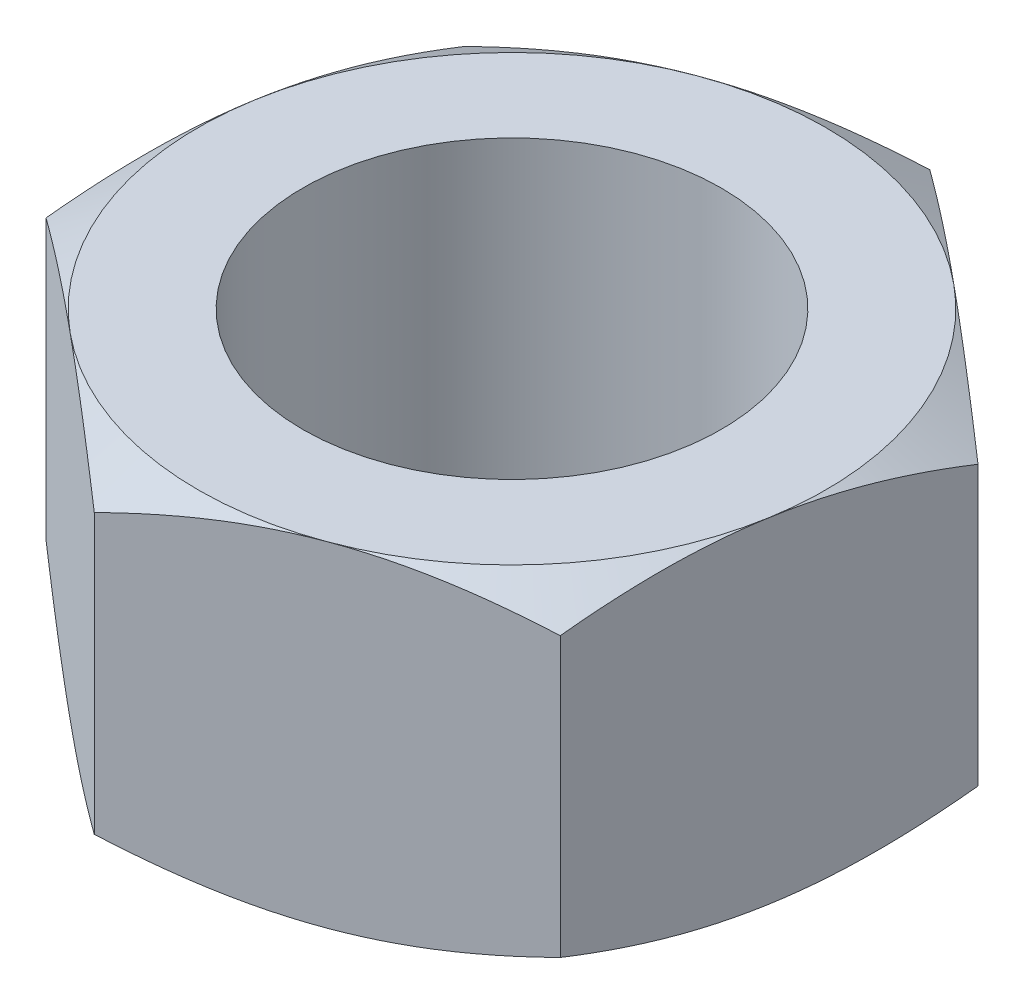
ISO-10303-21;
HEADER;
FILE_DESCRIPTION(('STEP AP214'),'2;1');
FILE_NAME('part.step','',(''),(''),'','','');
FILE_SCHEMA(('AUTOMOTIVE_DESIGN { 1 0 10303 214 1 1 1 1 }'));
ENDSEC;
DATA;
#1=APPLICATION_CONTEXT('core data for automotive mechanical design processes');
#2=APPLICATION_PROTOCOL_DEFINITION('international standard','automotive_design',2000,#1);
#3=PRODUCT_CONTEXT('',#1,'mechanical');
#4=PRODUCT('Part','Part','',(#3));
#5=PRODUCT_RELATED_PRODUCT_CATEGORY('part','',(#4));
#6=PRODUCT_DEFINITION_FORMATION('','',#4);
#7=PRODUCT_DEFINITION_CONTEXT('part definition',#1,'design');
#8=PRODUCT_DEFINITION('design','',#6,#7);
#9=PRODUCT_DEFINITION_SHAPE('','',#8);
#10=(LENGTH_UNIT() NAMED_UNIT(*) SI_UNIT(.MILLI.,.METRE.));
#11=(NAMED_UNIT(*) PLANE_ANGLE_UNIT() SI_UNIT($,.RADIAN.));
#12=(NAMED_UNIT(*) SI_UNIT($,.STERADIAN.) SOLID_ANGLE_UNIT());
#13=UNCERTAINTY_MEASURE_WITH_UNIT(LENGTH_MEASURE(1.E-05),#10,'distance_accuracy_value','');
#14=(GEOMETRIC_REPRESENTATION_CONTEXT(3) GLOBAL_UNCERTAINTY_ASSIGNED_CONTEXT((#13)) GLOBAL_UNIT_ASSIGNED_CONTEXT((#10,
#11,#12)) REPRESENTATION_CONTEXT('',''));
#15=CARTESIAN_POINT('',(0.,0.,0.));
#16=DIRECTION('',(0.,0.,1.));
#17=DIRECTION('',(1.,0.,0.));
#18=AXIS2_PLACEMENT_3D('',#15,#16,#17);
#19=CARTESIAN_POINT('',(-1.44369467023749,8.,8.53907171179209));
#20=DIRECTION('',(-0.34863406811952,0.,-0.937258921828133));
#21=DIRECTION('',(-0.937258921828133,0.,0.34863406811952));
#22=AXIS2_PLACEMENT_3D('',#19,#20,#21);
#23=PLANE('',#22);
#24=CARTESIAN_POINT('',(6.67340569203028,0.669934582085275,5.51973772123151));
#25=CARTESIAN_POINT('',(6.49498732644152,0.61499041368803,5.58610435607892));
#26=CARTESIAN_POINT('',(6.31590373120375,0.562539844764627,5.65271843772397));
#27=CARTESIAN_POINT('',(5.95628219341445,0.463312688605474,5.78648757748136));
#28=CARTESIAN_POINT('',(5.77574365902302,0.416538549046466,5.85364285574156));
#29=CARTESIAN_POINT('',(5.23123744179099,0.285648891076474,6.05618391799114));
#30=CARTESIAN_POINT('',(4.86512041892743,0.211200490063354,6.19236919627024));
#31=CARTESIAN_POINT('',(4.31723296252882,0.123901221271782,6.39616798478786));
#32=CARTESIAN_POINT('',(4.13709953241467,0.0990322370979437,6.46317257560309));
#33=CARTESIAN_POINT('',(3.77601876178583,0.0573306993877993,6.59748450910651));
#34=CARTESIAN_POINT('',(3.59507149461047,0.0404974357964017,6.66479182451452));
#35=CARTESIAN_POINT('',(3.23286270958824,0.0152963397422831,6.79952334777878));
#36=CARTESIAN_POINT('',(3.05160178328159,0.00691890019796405,6.86694733559865));
#37=CARTESIAN_POINT('',(2.68892251831363,-0.00119990207370901,7.0018538642255));
#38=CARTESIAN_POINT('',(2.50750418468866,-0.000941531608342203,7.0693364031591));
#39=CARTESIAN_POINT('',(2.01048216082673,0.0116366203444909,7.25421467541497));
#40=CARTESIAN_POINT('',(1.69504118336627,0.032750367326311,7.37154988414164));
#41=CARTESIAN_POINT('',(1.06625435166348,0.0997010500425559,7.60544097443817));
#42=CARTESIAN_POINT('',(0.752910708611471,0.145560867086196,7.72199603350715));
#43=CARTESIAN_POINT('',(0.122858541479935,0.260196634976687,7.95635779314358));
#44=CARTESIAN_POINT('',(-0.19377048564775,0.32945826489346,8.0741349230715));
#45=CARTESIAN_POINT('',(-0.822306823607496,0.486654039468555,8.30793283671146));
#46=CARTESIAN_POINT('',(-1.13422218333332,0.574551261711175,8.42395661438654));
#47=CARTESIAN_POINT('',(-1.44389467023749,0.669934582085275,8.53914610619048));
#48=B_SPLINE_CURVE_WITH_KNOTS('',3,(#24,#25,#26,#27,#28,#29,#30,#31,#32,#33,#34,#35,#36,#37,#38,
#39,#40,#41,#42,#43,#44,#45,#46,#47),.UNSPECIFIED.,.F.,.F.,(4,2,2,2,2,2,2,2,2,2,2,4),(0.,
0.594350167566524,1.18895571516085,2.38063749631713,2.96188394546358,3.54307902480116,
4.12361303374696,4.70412910684701,5.71472439101079,6.7262557214494,7.76022088252539,
8.79215629474527),.UNSPECIFIED.);
#49=CARTESIAN_POINT('',(6.67320569203028,0.669872981077802,5.5198121156299));
#50=VERTEX_POINT('',#49);
#51=CARTESIAN_POINT('',(2.6147555108964,0.,7.029441913711));
#52=VERTEX_POINT('',#51);
#53=EDGE_CURVE('E125',#50,#52,#48,.T.);
#54=ORIENTED_EDGE('',*,*,#53,.F.);
#55=DIRECTION('',(0.,-1.,0.));
#56=VECTOR('',#55,1.);
#57=CARTESIAN_POINT('',(6.67320569203028,8.,5.5198121156299));
#58=LINE('',#57,#56);
#59=CARTESIAN_POINT('',(6.67320569203028,7.3301270189222,5.5198121156299));
#60=VERTEX_POINT('',#59);
#61=EDGE_CURVE('E247',#60,#50,#58,.T.);
#62=ORIENTED_EDGE('',*,*,#61,.F.);
#63=CARTESIAN_POINT('',(-1.44389467023749,7.33006541791473,8.53914610619048));
#64=CARTESIAN_POINT('',(-1.26547630464873,7.38500958631197,8.47277947134307));
#65=CARTESIAN_POINT('',(-1.08639270941096,7.43746015523537,8.40616538969802));
#66=CARTESIAN_POINT('',(-0.726771171621659,7.53668731139453,8.27239624994063));
#67=CARTESIAN_POINT('',(-0.54623263723023,7.58346145095353,8.20524097168044));
#68=CARTESIAN_POINT('',(-0.00172641999819791,7.71435110892353,8.00269990943085));
#69=CARTESIAN_POINT('',(0.364390602865364,7.78879950993665,7.86651463115175));
#70=CARTESIAN_POINT('',(0.912278059263968,7.87609877872822,7.66271584263413));
#71=CARTESIAN_POINT('',(1.09241148937812,7.90096776290206,7.5957112518189));
#72=CARTESIAN_POINT('',(1.45349226000696,7.9426693006122,7.46139931831548));
#73=CARTESIAN_POINT('',(1.63443952718232,7.9595025642036,7.39409200290748));
#74=CARTESIAN_POINT('',(1.99664831220455,7.98470366025772,7.25936047964321));
#75=CARTESIAN_POINT('',(2.1779092385112,7.99308109980204,7.19193649182334));
#76=CARTESIAN_POINT('',(2.54058850347916,8.00119990207371,7.0570299631965));
#77=CARTESIAN_POINT('',(2.72200683710413,8.00094153160834,6.98954742426289));
#78=CARTESIAN_POINT('',(3.21902886096606,7.98836337965551,6.80466915200702));
#79=CARTESIAN_POINT('',(3.53446983842652,7.96724963267369,6.68733394328035));
#80=CARTESIAN_POINT('',(4.16325667012932,7.90029894995745,6.45344285298383));
#81=CARTESIAN_POINT('',(4.47660031318132,7.85443913291381,6.33688779391484));
#82=CARTESIAN_POINT('',(5.10665248031286,7.73980336502331,6.10252603427841));
#83=CARTESIAN_POINT('',(5.42328150744054,7.67054173510654,5.98474890435049));
#84=CARTESIAN_POINT('',(6.05181784540029,7.51334596053145,5.75095099071054));
#85=CARTESIAN_POINT('',(6.36373320512611,7.42544873828883,5.63492721303545));
#86=CARTESIAN_POINT('',(6.67340569203028,7.33006541791473,5.51973772123151));
#87=B_SPLINE_CURVE_WITH_KNOTS('',3,(#63,#64,#65,#66,#67,#68,#69,#70,#71,#72,#73,#74,#75,#76,#77,
#78,#79,#80,#81,#82,#83,#84,#85,#86),.UNSPECIFIED.,.F.,.F.,(4,2,2,2,2,2,2,2,2,2,2,4),(0.,
0.594350167566525,1.18895571516085,2.38063749631713,2.96188394546358,3.54307902480116,
4.12361303374695,4.704129106847,5.71472439101079,6.7262557214494,7.76022088252539,
8.79215629474526),.UNSPECIFIED.);
#88=CARTESIAN_POINT('',(2.6147555108964,8.,7.029441913711));
#89=VERTEX_POINT('',#88);
#90=EDGE_CURVE('E228',#89,#60,#87,.T.);
#91=ORIENTED_EDGE('',*,*,#90,.F.);
#92=CARTESIAN_POINT('',(-1.44369467023749,7.3301270189222,8.53907171179209));
#93=VERTEX_POINT('',#92);
#94=EDGE_CURVE('E233',#93,#89,#87,.T.);
#95=ORIENTED_EDGE('',*,*,#94,.F.);
#96=DIRECTION('',(0.,-1.,0.));
#97=VECTOR('',#96,1.);
#98=CARTESIAN_POINT('',(-1.44369467023749,8.,8.53907171179209));
#99=LINE('',#98,#97);
#100=CARTESIAN_POINT('',(-1.44369467023749,0.669872981077804,8.53907171179209));
#101=VERTEX_POINT('',#100);
#102=EDGE_CURVE('E155',#93,#101,#99,.T.);
#103=ORIENTED_EDGE('',*,*,#102,.T.);
#104=EDGE_CURVE('E137',#52,#101,#48,.T.);
#105=ORIENTED_EDGE('',*,*,#104,.F.);
#106=EDGE_LOOP('',(#54,#62,#91,#95,#103,#105));
#107=FACE_BOUND('',#106,.T.);
#108=ADVANCED_FACE('F35',(#107),#23,.F.);
#109=CARTESIAN_POINT('',(6.67320569203028,8.,5.5198121156299));
#110=DIRECTION('',(-0.986007070286536,0.,-0.166703501297848));
#111=DIRECTION('',(-0.166703501297848,0.,0.986007070286536));
#112=AXIS2_PLACEMENT_3D('',#109,#110,#111);
#113=PLANE('',#112);
#114=CARTESIAN_POINT('',(8.11693417612292,0.669931536480535,-3.01945959616219));
#115=CARTESIAN_POINT('',(8.08520019987834,0.614987494088027,-2.83176152922384));
#116=CARTESIAN_POINT('',(8.05334790409476,0.562537054216301,-2.64336363354107));
#117=CARTESIAN_POINT('',(7.98938463854219,0.463310161762978,-2.26503785404366));
#118=CARTESIAN_POINT('',(7.95727356350703,0.416536156859956,-2.07510934760759));
#119=CARTESIAN_POINT('',(7.86042620741353,0.285646912260097,-1.50228287963715));
#120=CARTESIAN_POINT('',(7.79530763940616,0.211198797092288,-1.1171237920216));
#121=CARTESIAN_POINT('',(7.69785888875528,0.123899954229493,-0.54074023448197));
#122=CARTESIAN_POINT('',(7.66581986681431,0.0990311093659153,-0.351237903019766));
#123=CARTESIAN_POINT('',(7.60159705945798,0.0573298489513181,0.0286229975251618));
#124=CARTESIAN_POINT('',(7.56941328708685,0.0404967233463565,0.218981489454664));
#125=CARTESIAN_POINT('',(7.50498984963335,0.01529589836571,0.600029063901351));
#126=CARTESIAN_POINT('',(7.47275028976229,0.00691859196391458,0.790717524121497));
#127=CARTESIAN_POINT('',(7.40824317319374,-0.00119995198440781,1.17226003837705));
#128=CARTESIAN_POINT('',(7.37597561739202,-0.000941456342233855,1.36311408711426));
#129=CARTESIAN_POINT('',(7.2875741645718,0.0116369901313172,1.88598527353643));
#130=CARTESIAN_POINT('',(7.23146920871259,0.0327507878641885,2.21783123192727));
#131=CARTESIAN_POINT('',(7.11963193933104,0.0997013333310603,2.87931906795497));
#132=CARTESIAN_POINT('',(7.06390001908873,0.145560961828871,3.20895861944455));
#133=CARTESIAN_POINT('',(6.95183769884847,0.260196141216312,3.87177757171231));
#134=CARTESIAN_POINT('',(6.89552143817182,0.329457363606809,4.20487334214886));
#135=CARTESIAN_POINT('',(6.78372872548718,0.486652168279931,4.86609763711207));
#136=CARTESIAN_POINT('',(6.72825084191222,0.574548828915974,5.19423462897829));
#137=CARTESIAN_POINT('',(6.67317187817512,0.669931536480536,5.5200121156299));
#138=B_SPLINE_CURVE_WITH_KNOTS('',3,(#114,#115,#116,#117,#118,#119,#120,#121,#122,#123,#124,
#125,#126,#127,#128,#129,#130,#131,#132,#133,#134,#135,#136,#137),.UNSPECIFIED.,.F.,.F.,(4,2,2,
2,2,2,2,2,2,2,2,4),(0.,0.594349806644114,1.1889549931035,2.380636032122,2.96188215456027,
3.54307690729336,4.12361059346092,4.70412634350593,5.71471695893529,6.72624360304106,
7.76020382983172,8.79213434275382),.UNSPECIFIED.);
#139=CARTESIAN_POINT('',(8.11690036226776,0.669872981077801,-3.01925959616219));
#140=VERTEX_POINT('',#139);
#141=CARTESIAN_POINT('',(7.39505302714902,0.,1.25027625973386));
#142=VERTEX_POINT('',#141);
#143=EDGE_CURVE('E52',#140,#142,#138,.T.);
#144=ORIENTED_EDGE('',*,*,#143,.F.);
#145=DIRECTION('',(0.,-1.,0.));
#146=VECTOR('',#145,1.);
#147=CARTESIAN_POINT('',(8.11690036226776,8.,-3.01925959616219));
#148=LINE('',#147,#146);
#149=CARTESIAN_POINT('',(8.11690036226776,7.3301270189222,-3.01925959616219));
#150=VERTEX_POINT('',#149);
#151=EDGE_CURVE('E244',#150,#140,#148,.T.);
#152=ORIENTED_EDGE('',*,*,#151,.F.);
#153=CARTESIAN_POINT('',(6.67317187817512,7.33006846351947,5.5200121156299));
#154=CARTESIAN_POINT('',(6.7049058544197,7.38501250591197,5.33231404869155));
#155=CARTESIAN_POINT('',(6.73675815020328,7.4374629457837,5.14391615300878));
#156=CARTESIAN_POINT('',(6.80072141575585,7.53668983823702,4.76559037351137));
#157=CARTESIAN_POINT('',(6.83283249079101,7.58346384314005,4.57566186707531));
#158=CARTESIAN_POINT('',(6.92967984688451,7.71435308773991,4.00283539910487));
#159=CARTESIAN_POINT('',(6.99479841489188,7.78880120290771,3.61767631148931));
#160=CARTESIAN_POINT('',(7.09224716554276,7.87610004577051,3.04129275394969));
#161=CARTESIAN_POINT('',(7.12428618748373,7.90096889063409,2.85179042248748));
#162=CARTESIAN_POINT('',(7.18850899484006,7.94267015104868,2.47192952194255));
#163=CARTESIAN_POINT('',(7.22069276721119,7.95950327665365,2.28157103001305));
#164=CARTESIAN_POINT('',(7.28511620466469,7.98470410163429,1.90052345556636));
#165=CARTESIAN_POINT('',(7.31735576453575,7.99308140803609,1.70983499534622));
#166=CARTESIAN_POINT('',(7.3818628811043,8.00119995198441,1.32829248109066));
#167=CARTESIAN_POINT('',(7.41413043690602,8.00094145634224,1.13743843235345));
#168=CARTESIAN_POINT('',(7.50253188972624,7.98836300986868,0.614567245931289));
#169=CARTESIAN_POINT('',(7.55863684558545,7.96724921213581,0.282721287540443));
#170=CARTESIAN_POINT('',(7.670474114967,7.90029866666894,-0.378766548487257));
#171=CARTESIAN_POINT('',(7.72620603520931,7.85443903817113,-0.708406099976839));
#172=CARTESIAN_POINT('',(7.83826835544957,7.73980385878369,-1.3712250522446));
#173=CARTESIAN_POINT('',(7.89458461612622,7.67054263639319,-1.70432082268115));
#174=CARTESIAN_POINT('',(8.00637732881086,7.51334783172007,-2.36554511764435));
#175=CARTESIAN_POINT('',(8.06185521238582,7.42545117108403,-2.69368210951058));
#176=CARTESIAN_POINT('',(8.11693417612292,7.33006846351947,-3.01945959616219));
#177=B_SPLINE_CURVE_WITH_KNOTS('',3,(#153,#154,#155,#156,#157,#158,#159,#160,#161,#162,#163,
#164,#165,#166,#167,#168,#169,#170,#171,#172,#173,#174,#175,#176),.UNSPECIFIED.,.F.,.F.,(4,2,2,
2,2,2,2,2,2,2,2,4),(0.,0.594349806644116,1.18895499310351,2.380636032122,2.96188215456027,
3.54307690729336,4.12361059346092,4.70412634350593,5.71471695893529,6.72624360304106,
7.76020382983172,8.79213434275382),.UNSPECIFIED.);
#178=CARTESIAN_POINT('',(7.39505302714903,8.,1.25027625973386));
#179=VERTEX_POINT('',#178);
#180=EDGE_CURVE('E215',#179,#150,#177,.T.);
#181=ORIENTED_EDGE('',*,*,#180,.F.);
#182=EDGE_CURVE('E221',#60,#179,#177,.T.);
#183=ORIENTED_EDGE('',*,*,#182,.F.);
#184=ORIENTED_EDGE('',*,*,#61,.T.);
#185=EDGE_CURVE('E131',#142,#50,#138,.T.);
#186=ORIENTED_EDGE('',*,*,#185,.F.);
#187=EDGE_LOOP('',(#144,#152,#181,#183,#184,#186));
#188=FACE_BOUND('',#187,.T.);
#189=ADVANCED_FACE('F207',(#188),#113,.F.);
#190=CARTESIAN_POINT('',(8.11690036226776,8.,-3.01925959616219));
#191=DIRECTION('',(-0.637373002167017,0.,0.770555420530285));
#192=DIRECTION('',(0.770555420530285,0.,0.637373002167017));
#193=AXIS2_PLACEMENT_3D('',#190,#191,#192);
#194=PLANE('',#193);
#195=CARTESIAN_POINT('',(1.44349467023748,0.669947909270021,-8.53923714389085));
#196=CARTESIAN_POINT('',(1.59017934429502,0.615003189494996,-8.41790537646055));
#197=CARTESIAN_POINT('',(1.73741092985964,0.56255205586088,-8.29612122543796));
#198=CARTESIAN_POINT('',(2.03306978023781,0.463323745764642,-8.05156390475479));
#199=CARTESIAN_POINT('',(2.18149753162802,0.416549016971252,-7.9287903326172));
#200=CARTESIAN_POINT('',(2.62915730228068,0.2856575501553,-7.55850385565761));
#201=CARTESIAN_POINT('',(2.93015638802545,0.211207898325488,-7.30952930325144));
#202=CARTESIAN_POINT('',(3.38059604417727,0.123906765731987,-6.93694341482957));
#203=CARTESIAN_POINT('',(3.52869074651668,0.0990371719568291,-6.81444532770932));
#204=CARTESIAN_POINT('',(3.82554931567242,0.0573344208415768,-6.56889564704964));
#205=CARTESIAN_POINT('',(3.97431312219173,0.0405005534413595,-6.44584410338552));
#206=CARTESIAN_POINT('',(4.27209910847214,0.0152982712082999,-6.19952729991901));
#207=CARTESIAN_POINT('',(4.42112080187179,0.00692024905105385,-6.0762624424156));
#208=CARTESIAN_POINT('',(4.71929362297594,-0.00119968360760581,-5.82962566446526));
#209=CARTESIAN_POINT('',(4.86844474653955,-0.000941860898707517,-5.7062537474435));
#210=CARTESIAN_POINT('',(5.27707067658354,0.011635002250856,-5.36825452135774));
#211=CARTESIAN_POINT('',(5.53641172314485,0.0327485271370408,-5.15373785321444));
#212=CARTESIAN_POINT('',(6.05337129392387,0.0996998104171765,-4.72612931936019));
#213=CARTESIAN_POINT('',(6.31098800006821,0.14556045250706,-4.51303895748772));
#214=CARTESIAN_POINT('',(6.82898795637013,0.260198795605914,-4.08456985783058));
#215=CARTESIAN_POINT('',(7.0893058444828,0.329462208806821,-3.86924518494727));
#216=CARTESIAN_POINT('',(7.60605953930169,0.486662227553499,-3.44180694355387));
#217=CARTESIAN_POINT('',(7.86250196394722,0.574561907317877,-3.22968790094584));
#218=CARTESIAN_POINT('',(8.11710036226776,0.66994790927002,-3.01909416406342));
#219=B_SPLINE_CURVE_WITH_KNOTS('',3,(#195,#196,#197,#198,#199,#200,#201,#202,#203,#204,#205,
#206,#207,#208,#209,#210,#211,#212,#213,#214,#215,#216,#217,#218),.UNSPECIFIED.,.F.,.F.,(4,2,2,
2,2,2,2,2,2,2,2,4),(0.,0.594351746917321,1.18895887479238,2.38064390344968,2.96189178223027,
3.54308829074832,4.12362371213127,4.70414119887973,5.71475691272487,6.72630874985524,
7.76029550264454,8.792252353473),.UNSPECIFIED.);
#220=CARTESIAN_POINT('',(1.44369467023748,0.669872981077803,-8.53907171179209));
#221=VERTEX_POINT('',#220);
#222=CARTESIAN_POINT('',(4.78029751625262,0.,-5.77916565397714));
#223=VERTEX_POINT('',#222);
#224=EDGE_CURVE('E59',#221,#223,#219,.T.);
#225=ORIENTED_EDGE('',*,*,#224,.F.);
#226=DIRECTION('',(0.,-1.,0.));
#227=VECTOR('',#226,1.);
#228=CARTESIAN_POINT('',(1.44369467023748,8.,-8.53907171179209));
#229=LINE('',#228,#227);
#230=CARTESIAN_POINT('',(1.44369467023748,7.3301270189222,-8.53907171179209));
#231=VERTEX_POINT('',#230);
#232=EDGE_CURVE('E241',#231,#221,#229,.T.);
#233=ORIENTED_EDGE('',*,*,#232,.F.);
#234=CARTESIAN_POINT('',(8.11710036226776,7.33005209072998,-3.01909416406342));
#235=CARTESIAN_POINT('',(7.97041568821022,7.38499681050501,-3.14042593149373));
#236=CARTESIAN_POINT('',(7.82318410264561,7.43744794413912,-3.26221008251631));
#237=CARTESIAN_POINT('',(7.52752525226744,7.53667625423536,-3.50676740319948));
#238=CARTESIAN_POINT('',(7.37909750087722,7.58345098302875,-3.62954097533707));
#239=CARTESIAN_POINT('',(6.93143773022457,7.7143424498447,-3.99982745229667));
#240=CARTESIAN_POINT('',(6.63043864447979,7.78879210167451,-4.24880200470283));
#241=CARTESIAN_POINT('',(6.17999898832797,7.87609323426802,-4.62138789312471));
#242=CARTESIAN_POINT('',(6.03190428598856,7.90096282804317,-4.74388598024496));
#243=CARTESIAN_POINT('',(5.73504571683282,7.94266557915843,-4.98943566090464));
#244=CARTESIAN_POINT('',(5.58628191031352,7.95949944655864,-5.11248720456875));
#245=CARTESIAN_POINT('',(5.28849592403311,7.9847017287917,-5.35880400803526));
#246=CARTESIAN_POINT('',(5.13947423063345,7.99307975094895,-5.48206886553868));
#247=CARTESIAN_POINT('',(4.8413014095293,8.00119968360761,-5.72870564348902));
#248=CARTESIAN_POINT('',(4.69215028596569,8.00094186089871,-5.85207756051077));
#249=CARTESIAN_POINT('',(4.2835243559217,7.98836499774915,-6.19007678659654));
#250=CARTESIAN_POINT('',(4.02418330936039,7.96725147286296,-6.40459345473984));
#251=CARTESIAN_POINT('',(3.50722373858137,7.90030018958282,-6.83220198859408));
#252=CARTESIAN_POINT('',(3.24960703243704,7.85443954749294,-7.04529235046655));
#253=CARTESIAN_POINT('',(2.73160707613511,7.73980120439409,-7.47376145012369));
#254=CARTESIAN_POINT('',(2.47128918802245,7.67053779119318,-7.68908612300701));
#255=CARTESIAN_POINT('',(1.95453549320356,7.5133377724465,-8.1165243644004));
#256=CARTESIAN_POINT('',(1.69809306855803,7.42543809268213,-8.32864340700843));
#257=CARTESIAN_POINT('',(1.44349467023748,7.33005209072998,-8.53923714389085));
#258=B_SPLINE_CURVE_WITH_KNOTS('',3,(#234,#235,#236,#237,#238,#239,#240,#241,#242,#243,#244,
#245,#246,#247,#248,#249,#250,#251,#252,#253,#254,#255,#256,#257),.UNSPECIFIED.,.F.,.F.,(4,2,2,
2,2,2,2,2,2,2,2,4),(0.,0.594351746917323,1.18895887479238,2.38064390344967,2.96189178223027,
3.54308829074832,4.12362371213127,4.70414119887973,5.71475691272487,6.72630874985524,
7.76029550264454,8.79225235347299),.UNSPECIFIED.);
#259=CARTESIAN_POINT('',(4.78029751625262,8.,-5.77916565397714));
#260=VERTEX_POINT('',#259);
#261=EDGE_CURVE('E223',#260,#231,#258,.T.);
#262=ORIENTED_EDGE('',*,*,#261,.F.);
#263=EDGE_CURVE('E222',#150,#260,#258,.T.);
#264=ORIENTED_EDGE('',*,*,#263,.F.);
#265=ORIENTED_EDGE('',*,*,#151,.T.);
#266=EDGE_CURVE('E201',#223,#140,#219,.T.);
#267=ORIENTED_EDGE('',*,*,#266,.F.);
#268=EDGE_LOOP('',(#225,#233,#262,#264,#265,#267));
#269=FACE_BOUND('',#268,.T.);
#270=ADVANCED_FACE('F210',(#269),#194,.F.);
#271=CARTESIAN_POINT('',(1.44369467023748,8.,-8.53907171179209));
#272=DIRECTION('',(0.34863406811952,0.,0.937258921828133));
#273=DIRECTION('',(0.937258921828133,0.,-0.34863406811952));
#274=AXIS2_PLACEMENT_3D('',#271,#272,#273);
#275=PLANE('',#274);
#276=CARTESIAN_POINT('',(-6.67340569203028,0.669934582085276,-5.51973772123152));
#277=CARTESIAN_POINT('',(-6.49498732644152,0.614990413688031,-5.58610435607893));
#278=CARTESIAN_POINT('',(-6.31590373120376,0.562539844764629,-5.65271843772398));
#279=CARTESIAN_POINT('',(-5.95628219341445,0.463312688605475,-5.78648757748136));
#280=CARTESIAN_POINT('',(-5.77574365902302,0.416538549046468,-5.85364285574156));
#281=CARTESIAN_POINT('',(-5.23123744179099,0.285648891076476,-6.05618391799115));
#282=CARTESIAN_POINT('',(-4.86512041892743,0.211200490063354,-6.19236919627024));
#283=CARTESIAN_POINT('',(-4.31723296252883,0.123901221271783,-6.39616798478786));
#284=CARTESIAN_POINT('',(-4.13709953241468,0.0990322370979448,-6.46317257560309));
#285=CARTESIAN_POINT('',(-3.77601876178583,0.0573306993878005,-6.59748450910651));
#286=CARTESIAN_POINT('',(-3.59507149461047,0.0404974357964028,-6.66479182451452));
#287=CARTESIAN_POINT('',(-3.23286270958824,0.0152963397422842,-6.79952334777878));
#288=CARTESIAN_POINT('',(-3.05160178328159,0.00691890019796537,-6.86694733559865));
#289=CARTESIAN_POINT('',(-2.68892251831363,-0.00119990207370781,-7.0018538642255));
#290=CARTESIAN_POINT('',(-2.50750418468866,-0.00094153160834132,-7.0693364031591));
#291=CARTESIAN_POINT('',(-2.01048216082673,0.0116366203444915,-7.25421467541497));
#292=CARTESIAN_POINT('',(-1.69504118336627,0.0327503673263118,-7.37154988414164));
#293=CARTESIAN_POINT('',(-1.06625435166348,0.0997010500425568,-7.60544097443817));
#294=CARTESIAN_POINT('',(-0.752910708611473,0.145560867086196,-7.72199603350715));
#295=CARTESIAN_POINT('',(-0.122858541479938,0.260196634976688,-7.95635779314358));
#296=CARTESIAN_POINT('',(0.193770485647746,0.329458264893461,-8.0741349230715));
#297=CARTESIAN_POINT('',(0.822306823607491,0.486654039468555,-8.30793283671146));
#298=CARTESIAN_POINT('',(1.13422218333331,0.574551261711174,-8.42395661438654));
#299=CARTESIAN_POINT('',(1.44389467023748,0.669934582085274,-8.53914610619048));
#300=B_SPLINE_CURVE_WITH_KNOTS('',3,(#276,#277,#278,#279,#280,#281,#282,#283,#284,#285,#286,
#287,#288,#289,#290,#291,#292,#293,#294,#295,#296,#297,#298,#299),.UNSPECIFIED.,.F.,.F.,(4,2,2,
2,2,2,2,2,2,2,2,4),(0.,0.594350167566525,1.18895571516085,2.38063749631713,2.96188394546358,
3.54307902480116,4.12361303374696,4.70412910684701,5.71472439101079,6.7262557214494,
7.76022088252539,8.79215629474526),.UNSPECIFIED.);
#301=CARTESIAN_POINT('',(-6.67320569203028,0.669872981077804,-5.5198121156299));
#302=VERTEX_POINT('',#301);
#303=CARTESIAN_POINT('',(-2.6147555108964,0.,-7.029441913711));
#304=VERTEX_POINT('',#303);
#305=EDGE_CURVE('E168',#302,#304,#300,.T.);
#306=ORIENTED_EDGE('',*,*,#305,.F.);
#307=DIRECTION('',(0.,-1.,0.));
#308=VECTOR('',#307,1.);
#309=CARTESIAN_POINT('',(-6.67320569203028,8.,-5.5198121156299));
#310=LINE('',#309,#308);
#311=CARTESIAN_POINT('',(-6.67320569203028,7.3301270189222,-5.5198121156299));
#312=VERTEX_POINT('',#311);
#313=EDGE_CURVE('E238',#312,#302,#310,.T.);
#314=ORIENTED_EDGE('',*,*,#313,.F.);
#315=CARTESIAN_POINT('',(1.44389467023748,7.33006541791473,-8.53914610619048));
#316=CARTESIAN_POINT('',(1.26547630464873,7.38500958631197,-8.47277947134307));
#317=CARTESIAN_POINT('',(1.08639270941096,7.43746015523537,-8.40616538969802));
#318=CARTESIAN_POINT('',(0.726771171621654,7.53668731139453,-8.27239624994063));
#319=CARTESIAN_POINT('',(0.546232637230224,7.58346145095354,-8.20524097168044));
#320=CARTESIAN_POINT('',(0.00172641999819325,7.71435110892353,-8.00269990943085));
#321=CARTESIAN_POINT('',(-0.364390602865369,7.78879950993665,-7.86651463115175));
#322=CARTESIAN_POINT('',(-0.912278059263972,7.87609877872822,-7.66271584263413));
#323=CARTESIAN_POINT('',(-1.09241148937812,7.90096776290206,-7.5957112518189));
#324=CARTESIAN_POINT('',(-1.45349226000697,7.9426693006122,-7.46139931831548));
#325=CARTESIAN_POINT('',(-1.63443952718233,7.9595025642036,-7.39409200290748));
#326=CARTESIAN_POINT('',(-1.99664831220456,7.98470366025772,-7.25936047964321));
#327=CARTESIAN_POINT('',(-2.17790923851121,7.99308109980204,-7.19193649182334));
#328=CARTESIAN_POINT('',(-2.54058850347917,8.00119990207371,-7.0570299631965));
#329=CARTESIAN_POINT('',(-2.72200683710413,8.00094153160834,-6.98954742426289));
#330=CARTESIAN_POINT('',(-3.21902886096607,7.98836337965551,-6.80466915200702));
#331=CARTESIAN_POINT('',(-3.53446983842653,7.96724963267369,-6.68733394328035));
#332=CARTESIAN_POINT('',(-4.16325667012932,7.90029894995744,-6.45344285298383));
#333=CARTESIAN_POINT('',(-4.47660031318133,7.8544391329138,-6.33688779391484));
#334=CARTESIAN_POINT('',(-5.10665248031286,7.73980336502331,-6.10252603427841));
#335=CARTESIAN_POINT('',(-5.42328150744054,7.67054173510654,-5.98474890435049));
#336=CARTESIAN_POINT('',(-6.05181784540029,7.51334596053145,-5.75095099071054));
#337=CARTESIAN_POINT('',(-6.36373320512611,7.42544873828883,-5.63492721303545));
#338=CARTESIAN_POINT('',(-6.67340569203028,7.33006541791473,-5.51973772123152));
#339=B_SPLINE_CURVE_WITH_KNOTS('',3,(#315,#316,#317,#318,#319,#320,#321,#322,#323,#324,#325,
#326,#327,#328,#329,#330,#331,#332,#333,#334,#335,#336,#337,#338),.UNSPECIFIED.,.F.,.F.,(4,2,2,
2,2,2,2,2,2,2,2,4),(0.,0.594350167566525,1.18895571516085,2.38063749631713,2.96188394546358,
3.54307902480116,4.12361303374696,4.70412910684701,5.71472439101079,6.7262557214494,
7.76022088252539,8.79215629474526),.UNSPECIFIED.);
#340=CARTESIAN_POINT('',(-2.6147555108964,8.,-7.029441913711));
#341=VERTEX_POINT('',#340);
#342=EDGE_CURVE('E283',#341,#312,#339,.T.);
#343=ORIENTED_EDGE('',*,*,#342,.F.);
#344=EDGE_CURVE('E445',#231,#341,#339,.T.);
#345=ORIENTED_EDGE('',*,*,#344,.F.);
#346=ORIENTED_EDGE('',*,*,#232,.T.);
#347=EDGE_CURVE('E449',#304,#221,#300,.T.);
#348=ORIENTED_EDGE('',*,*,#347,.F.);
#349=EDGE_LOOP('',(#306,#314,#343,#345,#346,#348));
#350=FACE_BOUND('',#349,.T.);
#351=ADVANCED_FACE('F298',(#350),#275,.F.);
#352=CARTESIAN_POINT('',(-6.67320569203028,8.,-5.5198121156299));
#353=DIRECTION('',(0.986007070286536,0.,0.166703501297848));
#354=DIRECTION('',(0.166703501297848,0.,-0.986007070286536));
#355=AXIS2_PLACEMENT_3D('',#352,#353,#354);
#356=PLANE('',#355);
#357=CARTESIAN_POINT('',(-8.11693417612292,0.669931536480537,3.01945959616219));
#358=CARTESIAN_POINT('',(-8.08520019987835,0.61498749408803,2.83176152922384));
#359=CARTESIAN_POINT('',(-8.05334790409477,0.562537054216303,2.64336363354107));
#360=CARTESIAN_POINT('',(-7.98938463854219,0.46331016176298,2.26503785404365));
#361=CARTESIAN_POINT('',(-7.95727356350704,0.416536156859958,2.07510934760759));
#362=CARTESIAN_POINT('',(-7.86042620741353,0.285646912260098,1.50228287963715));
#363=CARTESIAN_POINT('',(-7.79530763940617,0.21119879709229,1.1171237920216));
#364=CARTESIAN_POINT('',(-7.69785888875528,0.123899954229495,0.540740234481968));
#365=CARTESIAN_POINT('',(-7.66581986681432,0.0990311093659176,0.351237903019765));
#366=CARTESIAN_POINT('',(-7.60159705945799,0.0573298489513206,-0.0286229975251638));
#367=CARTESIAN_POINT('',(-7.56941328708686,0.040496723346359,-0.218981489454666));
#368=CARTESIAN_POINT('',(-7.50498984963335,0.0152958983657123,-0.600029063901353));
#369=CARTESIAN_POINT('',(-7.47275028976229,0.00691859196391657,-0.790717524121499));
#370=CARTESIAN_POINT('',(-7.40824317319375,-0.00119995198440554,-1.17226003837705));
#371=CARTESIAN_POINT('',(-7.37597561739202,-0.000941456342231071,-1.36311408711427));
#372=CARTESIAN_POINT('',(-7.28757416457181,0.0116369901313206,-1.88598527353643));
#373=CARTESIAN_POINT('',(-7.2314692087126,0.0327507878641913,-2.21783123192727));
#374=CARTESIAN_POINT('',(-7.11963193933104,0.0997013333310626,-2.87931906795497));
#375=CARTESIAN_POINT('',(-7.06390001908873,0.145560961828873,-3.20895861944456));
#376=CARTESIAN_POINT('',(-6.95183769884847,0.260196141216314,-3.87177757171231));
#377=CARTESIAN_POINT('',(-6.89552143817182,0.329457363606811,-4.20487334214886));
#378=CARTESIAN_POINT('',(-6.78372872548718,0.486652168279932,-4.86609763711207));
#379=CARTESIAN_POINT('',(-6.72825084191222,0.574548828915975,-5.19423462897829));
#380=CARTESIAN_POINT('',(-6.67317187817512,0.669931536480537,-5.5200121156299));
#381=B_SPLINE_CURVE_WITH_KNOTS('',3,(#357,#358,#359,#360,#361,#362,#363,#364,#365,#366,#367,
#368,#369,#370,#371,#372,#373,#374,#375,#376,#377,#378,#379,#380),.UNSPECIFIED.,.F.,.F.,(4,2,2,
2,2,2,2,2,2,2,2,4),(0.,0.594349806644116,1.18895499310351,2.380636032122,2.96188215456027,
3.54307690729336,4.12361059346092,4.70412634350593,5.71471695893529,6.72624360304106,
7.76020382983172,8.79213434275382),.UNSPECIFIED.);
#382=CARTESIAN_POINT('',(-8.11690036226777,0.669872981077805,3.01925959616219));
#383=VERTEX_POINT('',#382);
#384=CARTESIAN_POINT('',(-7.39505302714902,0.,-1.25027625973386));
#385=VERTEX_POINT('',#384);
#386=EDGE_CURVE('E156',#383,#385,#381,.T.);
#387=ORIENTED_EDGE('',*,*,#386,.F.);
#388=DIRECTION('',(0.,-1.,0.));
#389=VECTOR('',#388,1.);
#390=CARTESIAN_POINT('',(-8.11690036226777,8.,3.01925959616219));
#391=LINE('',#390,#389);
#392=CARTESIAN_POINT('',(-8.11690036226777,7.3301270189222,3.01925959616219));
#393=VERTEX_POINT('',#392);
#394=EDGE_CURVE('E235',#393,#383,#391,.T.);
#395=ORIENTED_EDGE('',*,*,#394,.F.);
#396=CARTESIAN_POINT('',(-6.67317187817512,7.33006846351946,-5.5200121156299));
#397=CARTESIAN_POINT('',(-6.7049058544197,7.38501250591197,-5.33231404869155));
#398=CARTESIAN_POINT('',(-6.73675815020328,7.4374629457837,-5.14391615300879));
#399=CARTESIAN_POINT('',(-6.80072141575586,7.53668983823702,-4.76559037351137));
#400=CARTESIAN_POINT('',(-6.83283249079101,7.58346384314004,-4.57566186707531));
#401=CARTESIAN_POINT('',(-6.92967984688451,7.7143530877399,-4.00283539910487));
#402=CARTESIAN_POINT('',(-6.99479841489188,7.78880120290771,-3.61767631148931));
#403=CARTESIAN_POINT('',(-7.09224716554277,7.87610004577051,-3.04129275394969));
#404=CARTESIAN_POINT('',(-7.12428618748373,7.90096889063408,-2.85179042248748));
#405=CARTESIAN_POINT('',(-7.18850899484006,7.94267015104868,-2.47192952194255));
#406=CARTESIAN_POINT('',(-7.22069276721119,7.95950327665364,-2.28157103001305));
#407=CARTESIAN_POINT('',(-7.28511620466469,7.98470410163429,-1.90052345556636));
#408=CARTESIAN_POINT('',(-7.31735576453576,7.99308140803609,-1.70983499534622));
#409=CARTESIAN_POINT('',(-7.3818628811043,8.00119995198441,-1.32829248109066));
#410=CARTESIAN_POINT('',(-7.41413043690603,8.00094145634223,-1.13743843235345));
#411=CARTESIAN_POINT('',(-7.50253188972624,7.98836300986868,-0.614567245931289));
#412=CARTESIAN_POINT('',(-7.55863684558545,7.96724921213581,-0.282721287540444));
#413=CARTESIAN_POINT('',(-7.67047411496701,7.90029866666894,0.378766548487257));
#414=CARTESIAN_POINT('',(-7.72620603520932,7.85443903817113,0.708406099976839));
#415=CARTESIAN_POINT('',(-7.83826835544957,7.73980385878369,1.3712250522446));
#416=CARTESIAN_POINT('',(-7.89458461612622,7.67054263639319,1.70432082268115));
#417=CARTESIAN_POINT('',(-8.00637732881086,7.51334783172007,2.36554511764435));
#418=CARTESIAN_POINT('',(-8.06185521238582,7.42545117108403,2.69368210951057));
#419=CARTESIAN_POINT('',(-8.11693417612292,7.33006846351946,3.01945959616219));
#420=B_SPLINE_CURVE_WITH_KNOTS('',3,(#396,#397,#398,#399,#400,#401,#402,#403,#404,#405,#406,
#407,#408,#409,#410,#411,#412,#413,#414,#415,#416,#417,#418,#419),.UNSPECIFIED.,.F.,.F.,(4,2,2,
2,2,2,2,2,2,2,2,4),(0.,0.594349806644115,1.18895499310351,2.380636032122,2.96188215456028,
3.54307690729336,4.12361059346092,4.70412634350593,5.71471695893529,6.72624360304106,
7.76020382983172,8.79213434275382),.UNSPECIFIED.);
#421=CARTESIAN_POINT('',(-7.39505302714903,8.,-1.25027625973386));
#422=VERTEX_POINT('',#421);
#423=EDGE_CURVE('E273',#422,#393,#420,.T.);
#424=ORIENTED_EDGE('',*,*,#423,.F.);
#425=EDGE_CURVE('E276',#312,#422,#420,.T.);
#426=ORIENTED_EDGE('',*,*,#425,.F.);
#427=ORIENTED_EDGE('',*,*,#313,.T.);
#428=EDGE_CURVE('E136',#385,#302,#381,.T.);
#429=ORIENTED_EDGE('',*,*,#428,.F.);
#430=EDGE_LOOP('',(#387,#395,#424,#426,#427,#429));
#431=FACE_BOUND('',#430,.T.);
#432=ADVANCED_FACE('F275',(#431),#356,.F.);
#433=CARTESIAN_POINT('',(-8.11690036226777,8.,3.01925959616219));
#434=DIRECTION('',(0.637373002167017,0.,-0.770555420530285));
#435=DIRECTION('',(-0.770555420530285,0.,-0.637373002167017));
#436=AXIS2_PLACEMENT_3D('',#433,#434,#435);
#437=PLANE('',#436);
#438=CARTESIAN_POINT('',(-1.44349467023749,0.669947909270022,8.53923714389085));
#439=CARTESIAN_POINT('',(-1.59017934429503,0.615003189494997,8.41790537646054));
#440=CARTESIAN_POINT('',(-1.73741092985964,0.56255205586088,8.29612122543796));
#441=CARTESIAN_POINT('',(-2.03306978023781,0.463323745764642,8.05156390475479));
#442=CARTESIAN_POINT('',(-2.18149753162803,0.416549016971254,7.9287903326172));
#443=CARTESIAN_POINT('',(-2.62915730228069,0.285657550155301,7.55850385565761));
#444=CARTESIAN_POINT('',(-2.93015638802546,0.21120789832549,7.30952930325144));
#445=CARTESIAN_POINT('',(-3.38059604417728,0.123906765731988,6.93694341482957));
#446=CARTESIAN_POINT('',(-3.52869074651669,0.0990371719568305,6.81444532770932));
#447=CARTESIAN_POINT('',(-3.82554931567243,0.0573344208415784,6.56889564704964));
#448=CARTESIAN_POINT('',(-3.97431312219174,0.0405005534413615,6.44584410338552));
#449=CARTESIAN_POINT('',(-4.27209910847214,0.0152982712083024,6.19952729991901));
#450=CARTESIAN_POINT('',(-4.4211208018718,0.00692024905105637,6.07626244241559));
#451=CARTESIAN_POINT('',(-4.71929362297595,-0.00119968360760332,5.82962566446526));
#452=CARTESIAN_POINT('',(-4.86844474653956,-0.000941860898705065,5.7062537474435));
#453=CARTESIAN_POINT('',(-5.27707067658355,0.0116350022508586,5.36825452135774));
#454=CARTESIAN_POINT('',(-5.53641172314486,0.0327485271370437,5.15373785321444));
#455=CARTESIAN_POINT('',(-6.05337129392388,0.0996998104171793,4.72612931936019));
#456=CARTESIAN_POINT('',(-6.31098800006821,0.145560452507062,4.51303895748772));
#457=CARTESIAN_POINT('',(-6.82898795637014,0.260198795605916,4.08456985783058));
#458=CARTESIAN_POINT('',(-7.0893058444828,0.329462208806824,3.86924518494727));
#459=CARTESIAN_POINT('',(-7.60605953930169,0.486662227553502,3.44180694355387));
#460=CARTESIAN_POINT('',(-7.86250196394722,0.57456190731788,3.22968790094584));
#461=CARTESIAN_POINT('',(-8.11710036226777,0.669947909270022,3.01909416406342));
#462=B_SPLINE_CURVE_WITH_KNOTS('',3,(#438,#439,#440,#441,#442,#443,#444,#445,#446,#447,#448,
#449,#450,#451,#452,#453,#454,#455,#456,#457,#458,#459,#460,#461),.UNSPECIFIED.,.F.,.F.,(4,2,2,
2,2,2,2,2,2,2,2,4),(0.,0.594351746917322,1.18895887479238,2.38064390344968,2.96189178223027,
3.54308829074832,4.12362371213127,4.70414119887973,5.71475691272487,6.72630874985524,
7.76029550264454,8.79225235347299),.UNSPECIFIED.);
#463=CARTESIAN_POINT('',(-4.78029751625263,0.,5.77916565397714));
#464=VERTEX_POINT('',#463);
#465=EDGE_CURVE('E143',#101,#464,#462,.T.);
#466=ORIENTED_EDGE('',*,*,#465,.F.);
#467=ORIENTED_EDGE('',*,*,#102,.F.);
#468=CARTESIAN_POINT('',(-8.11710036226777,7.33005209072998,3.01909416406342));
#469=CARTESIAN_POINT('',(-7.97041568821022,7.384996810505,3.14042593149373));
#470=CARTESIAN_POINT('',(-7.82318410264561,7.43744794413912,3.26221008251631));
#471=CARTESIAN_POINT('',(-7.52752525226744,7.53667625423536,3.50676740319948));
#472=CARTESIAN_POINT('',(-7.37909750087722,7.58345098302875,3.62954097533707));
#473=CARTESIAN_POINT('',(-6.93143773022457,7.7143424498447,3.99982745229667));
#474=CARTESIAN_POINT('',(-6.63043864447979,7.78879210167451,4.24880200470284));
#475=CARTESIAN_POINT('',(-6.17999898832797,7.87609323426801,4.62138789312471));
#476=CARTESIAN_POINT('',(-6.03190428598856,7.90096282804317,4.74388598024496));
#477=CARTESIAN_POINT('',(-5.73504571683283,7.94266557915842,4.98943566090464));
#478=CARTESIAN_POINT('',(-5.58628191031352,7.95949944655864,5.11248720456875));
#479=CARTESIAN_POINT('',(-5.28849592403311,7.9847017287917,5.35880400803526));
#480=CARTESIAN_POINT('',(-5.13947423063345,7.99307975094894,5.48206886553868));
#481=CARTESIAN_POINT('',(-4.84130140952931,8.00119968360761,5.72870564348902));
#482=CARTESIAN_POINT('',(-4.69215028596569,8.00094186089871,5.85207756051078));
#483=CARTESIAN_POINT('',(-4.2835243559217,7.98836499774914,6.19007678659654));
#484=CARTESIAN_POINT('',(-4.02418330936039,7.96725147286296,6.40459345473984));
#485=CARTESIAN_POINT('',(-3.50722373858138,7.90030018958282,6.83220198859408));
#486=CARTESIAN_POINT('',(-3.24960703243704,7.85443954749294,7.04529235046656));
#487=CARTESIAN_POINT('',(-2.73160707613512,7.73980120439409,7.4737614501237));
#488=CARTESIAN_POINT('',(-2.47128918802245,7.67053779119318,7.68908612300701));
#489=CARTESIAN_POINT('',(-1.95453549320356,7.5133377724465,8.11652436440041));
#490=CARTESIAN_POINT('',(-1.69809306855803,7.42543809268212,8.32864340700843));
#491=CARTESIAN_POINT('',(-1.44349467023749,7.33005209072998,8.53923714389085));
#492=B_SPLINE_CURVE_WITH_KNOTS('',3,(#468,#469,#470,#471,#472,#473,#474,#475,#476,#477,#478,
#479,#480,#481,#482,#483,#484,#485,#486,#487,#488,#489,#490,#491),.UNSPECIFIED.,.F.,.F.,(4,2,2,
2,2,2,2,2,2,2,2,4),(0.,0.594351746917323,1.18895887479238,2.38064390344968,2.96189178223027,
3.54308829074832,4.12362371213127,4.70414119887973,5.71475691272488,6.72630874985524,
7.76029550264454,8.79225235347299),.UNSPECIFIED.);
#493=CARTESIAN_POINT('',(-4.78029751625263,8.,5.77916565397714));
#494=VERTEX_POINT('',#493);
#495=EDGE_CURVE('E284',#494,#93,#492,.T.);
#496=ORIENTED_EDGE('',*,*,#495,.F.);
#497=EDGE_CURVE('E281',#393,#494,#492,.T.);
#498=ORIENTED_EDGE('',*,*,#497,.F.);
#499=ORIENTED_EDGE('',*,*,#394,.T.);
#500=EDGE_CURVE('E188',#464,#383,#462,.T.);
#501=ORIENTED_EDGE('',*,*,#500,.F.);
#502=EDGE_LOOP('',(#466,#467,#496,#498,#499,#501));
#503=FACE_BOUND('',#502,.T.);
#504=ADVANCED_FACE('F297',(#503),#437,.F.);
#505=CARTESIAN_POINT('',(0.,8.,0.));
#506=DIRECTION('',(0.,-1.,0.));
#507=DIRECTION('',(0.,0.,1.));
#508=AXIS2_PLACEMENT_3D('',#505,#506,#507);
#509=CONICAL_SURFACE('',#508,7.5,1.0471975511966);
#510=ORIENTED_EDGE('',*,*,#94,.T.);
#511=CARTESIAN_POINT('',(0.,8.,0.));
#512=DIRECTION('',(0.,1.,0.));
#513=DIRECTION('',(0.,0.,1.));
#514=AXIS2_PLACEMENT_3D('',#511,#512,#513);
#515=CIRCLE('',#514,7.5);
#516=EDGE_CURVE('E249',#494,#89,#515,.T.);
#517=ORIENTED_EDGE('',*,*,#516,.F.);
#518=ORIENTED_EDGE('',*,*,#495,.T.);
#519=EDGE_LOOP('',(#510,#517,#518));
#520=FACE_BOUND('',#519,.T.);
#521=ADVANCED_FACE('F183',(#520),#509,.T.);
#522=ORIENTED_EDGE('',*,*,#423,.T.);
#523=ORIENTED_EDGE('',*,*,#497,.T.);
#524=EDGE_CURVE('E251',#422,#494,#515,.T.);
#525=ORIENTED_EDGE('',*,*,#524,.F.);
#526=EDGE_LOOP('',(#522,#523,#525));
#527=FACE_BOUND('',#526,.T.);
#528=ADVANCED_FACE('F422',(#527),#509,.T.);
#529=ORIENTED_EDGE('',*,*,#342,.T.);
#530=ORIENTED_EDGE('',*,*,#425,.T.);
#531=EDGE_CURVE('E256',#341,#422,#515,.T.);
#532=ORIENTED_EDGE('',*,*,#531,.F.);
#533=EDGE_LOOP('',(#529,#530,#532));
#534=FACE_BOUND('',#533,.T.);
#535=ADVANCED_FACE('F424',(#534),#509,.T.);
#536=ORIENTED_EDGE('',*,*,#261,.T.);
#537=ORIENTED_EDGE('',*,*,#344,.T.);
#538=EDGE_CURVE('E258',#260,#341,#515,.T.);
#539=ORIENTED_EDGE('',*,*,#538,.F.);
#540=EDGE_LOOP('',(#536,#537,#539));
#541=FACE_BOUND('',#540,.T.);
#542=ADVANCED_FACE('F428',(#541),#509,.T.);
#543=ORIENTED_EDGE('',*,*,#180,.T.);
#544=ORIENTED_EDGE('',*,*,#263,.T.);
#545=EDGE_CURVE('E148',#179,#260,#515,.T.);
#546=ORIENTED_EDGE('',*,*,#545,.F.);
#547=EDGE_LOOP('',(#543,#544,#546));
#548=FACE_BOUND('',#547,.T.);
#549=ADVANCED_FACE('F433',(#548),#509,.T.);
#550=ORIENTED_EDGE('',*,*,#90,.T.);
#551=ORIENTED_EDGE('',*,*,#182,.T.);
#552=CARTESIAN_POINT('',(0.,8.,0.));
#553=DIRECTION('',(0.,1.,0.));
#554=DIRECTION('',(0.,0.,1.));
#555=AXIS2_PLACEMENT_3D('',#552,#553,#554);
#556=CIRCLE('',#555,7.5);
#557=EDGE_CURVE('E439',#89,#179,#556,.T.);
#558=ORIENTED_EDGE('',*,*,#557,.F.);
#559=EDGE_LOOP('',(#550,#551,#558));
#560=FACE_BOUND('',#559,.T.);
#561=ADVANCED_FACE('F396',(#560),#509,.T.);
#562=CARTESIAN_POINT('',(0.,8.,0.));
#563=DIRECTION('',(0.,1.,0.));
#564=DIRECTION('',(0.,0.,1.));
#565=AXIS2_PLACEMENT_3D('',#562,#563,#564);
#566=PLANE('',#565);
#567=CARTESIAN_POINT('',(0.,8.,0.));
#568=DIRECTION('',(0.,1.,0.));
#569=DIRECTION('',(0.,0.,1.));
#570=AXIS2_PLACEMENT_3D('',#567,#568,#569);
#571=CIRCLE('',#570,5.);
#572=CARTESIAN_POINT('',(0.,8.,5.));
#573=VERTEX_POINT('',#572);
#574=EDGE_CURVE('E414',#573,#573,#571,.T.);
#575=ORIENTED_EDGE('',*,*,#574,.F.);
#576=EDGE_LOOP('',(#575));
#577=FACE_BOUND('',#576,.T.);
#578=ORIENTED_EDGE('',*,*,#516,.T.);
#579=ORIENTED_EDGE('',*,*,#557,.T.);
#580=ORIENTED_EDGE('',*,*,#545,.T.);
#581=ORIENTED_EDGE('',*,*,#538,.T.);
#582=ORIENTED_EDGE('',*,*,#531,.T.);
#583=ORIENTED_EDGE('',*,*,#524,.T.);
#584=EDGE_LOOP('',(#578,#579,#580,#581,#582,#583));
#585=FACE_BOUND('',#584,.T.);
#586=ADVANCED_FACE('F267',(#577,#585),#566,.T.);
#587=CARTESIAN_POINT('',(0.,0.,0.));
#588=DIRECTION('',(0.,1.,0.));
#589=DIRECTION('',(0.,0.,-1.));
#590=AXIS2_PLACEMENT_3D('',#587,#588,#589);
#591=CONICAL_SURFACE('',#590,7.5,1.0471975511966);
#592=ORIENTED_EDGE('',*,*,#104,.T.);
#593=ORIENTED_EDGE('',*,*,#465,.T.);
#594=CARTESIAN_POINT('',(0.,0.,0.));
#595=DIRECTION('',(0.,1.,0.));
#596=DIRECTION('',(0.,0.,1.));
#597=AXIS2_PLACEMENT_3D('',#594,#595,#596);
#598=CIRCLE('',#597,7.5);
#599=EDGE_CURVE('E45',#464,#52,#598,.T.);
#600=ORIENTED_EDGE('',*,*,#599,.T.);
#601=EDGE_LOOP('',(#592,#593,#600));
#602=FACE_BOUND('',#601,.T.);
#603=ADVANCED_FACE('F141',(#602),#591,.T.);
#604=ORIENTED_EDGE('',*,*,#386,.T.);
#605=EDGE_CURVE('E147',#385,#464,#598,.T.);
#606=ORIENTED_EDGE('',*,*,#605,.T.);
#607=ORIENTED_EDGE('',*,*,#500,.T.);
#608=EDGE_LOOP('',(#604,#606,#607));
#609=FACE_BOUND('',#608,.T.);
#610=ADVANCED_FACE('F181',(#609),#591,.T.);
#611=ORIENTED_EDGE('',*,*,#305,.T.);
#612=EDGE_CURVE('E451',#304,#385,#598,.T.);
#613=ORIENTED_EDGE('',*,*,#612,.T.);
#614=ORIENTED_EDGE('',*,*,#428,.T.);
#615=EDGE_LOOP('',(#611,#613,#614));
#616=FACE_BOUND('',#615,.T.);
#617=ADVANCED_FACE('F180',(#616),#591,.T.);
#618=ORIENTED_EDGE('',*,*,#224,.T.);
#619=EDGE_CURVE('E44',#223,#304,#598,.T.);
#620=ORIENTED_EDGE('',*,*,#619,.T.);
#621=ORIENTED_EDGE('',*,*,#347,.T.);
#622=EDGE_LOOP('',(#618,#620,#621));
#623=FACE_BOUND('',#622,.T.);
#624=ADVANCED_FACE('F174',(#623),#591,.T.);
#625=ORIENTED_EDGE('',*,*,#266,.T.);
#626=ORIENTED_EDGE('',*,*,#143,.T.);
#627=CARTESIAN_POINT('',(0.,0.,0.));
#628=DIRECTION('',(0.,-1.,0.));
#629=DIRECTION('',(0.,0.,-1.));
#630=AXIS2_PLACEMENT_3D('',#627,#628,#629);
#631=CIRCLE('',#630,7.5);
#632=EDGE_CURVE('E151',#223,#142,#631,.T.);
#633=ORIENTED_EDGE('',*,*,#632,.F.);
#634=EDGE_LOOP('',(#625,#626,#633));
#635=FACE_BOUND('',#634,.T.);
#636=ADVANCED_FACE('F179',(#635),#591,.T.);
#637=ORIENTED_EDGE('',*,*,#185,.T.);
#638=ORIENTED_EDGE('',*,*,#53,.T.);
#639=EDGE_CURVE('E12',#52,#142,#598,.T.);
#640=ORIENTED_EDGE('',*,*,#639,.T.);
#641=EDGE_LOOP('',(#637,#638,#640));
#642=FACE_BOUND('',#641,.T.);
#643=ADVANCED_FACE('F127',(#642),#591,.T.);
#644=CARTESIAN_POINT('',(0.,0.,0.));
#645=DIRECTION('',(0.,1.,0.));
#646=DIRECTION('',(0.,0.,1.));
#647=AXIS2_PLACEMENT_3D('',#644,#645,#646);
#648=PLANE('',#647);
#649=CARTESIAN_POINT('',(0.,0.,0.));
#650=DIRECTION('',(0.,1.,0.));
#651=DIRECTION('',(0.,0.,1.));
#652=AXIS2_PLACEMENT_3D('',#649,#650,#651);
#653=CIRCLE('',#652,5.);
#654=CARTESIAN_POINT('',(0.,0.,5.));
#655=VERTEX_POINT('',#654);
#656=EDGE_CURVE('E39',#655,#655,#653,.T.);
#657=ORIENTED_EDGE('',*,*,#656,.T.);
#658=EDGE_LOOP('',(#657));
#659=FACE_BOUND('',#658,.T.);
#660=ORIENTED_EDGE('',*,*,#639,.F.);
#661=ORIENTED_EDGE('',*,*,#599,.F.);
#662=ORIENTED_EDGE('',*,*,#605,.F.);
#663=ORIENTED_EDGE('',*,*,#612,.F.);
#664=ORIENTED_EDGE('',*,*,#619,.F.);
#665=ORIENTED_EDGE('',*,*,#632,.T.);
#666=EDGE_LOOP('',(#660,#661,#662,#663,#664,#665));
#667=FACE_BOUND('',#666,.T.);
#668=ADVANCED_FACE('F149',(#659,#667),#648,.F.);
#669=CARTESIAN_POINT('',(0.,-2.,0.));
#670=DIRECTION('',(0.,1.,0.));
#671=DIRECTION('',(0.,0.,1.));
#672=AXIS2_PLACEMENT_3D('',#669,#670,#671);
#673=CYLINDRICAL_SURFACE('',#672,5.);
#674=ORIENTED_EDGE('',*,*,#574,.T.);
#675=EDGE_LOOP('',(#674));
#676=FACE_BOUND('',#675,.T.);
#677=ORIENTED_EDGE('',*,*,#656,.F.);
#678=EDGE_LOOP('',(#677));
#679=FACE_BOUND('',#678,.T.);
#680=ADVANCED_FACE('F182',(#676,#679),#673,.F.);
#681=CLOSED_SHELL('',(#108,#189,#270,#351,#432,#504,#521,#528,#535,#542,#549,#561,#586,#603,
#610,#617,#624,#636,#643,#668,#680));
#682=MANIFOLD_SOLID_BREP('B2',#681);
#683=ADVANCED_BREP_SHAPE_REPRESENTATION('',(#18,#682),#14);
#684=SHAPE_DEFINITION_REPRESENTATION(#9,#683);
ENDSEC;
END-ISO-10303-21;
